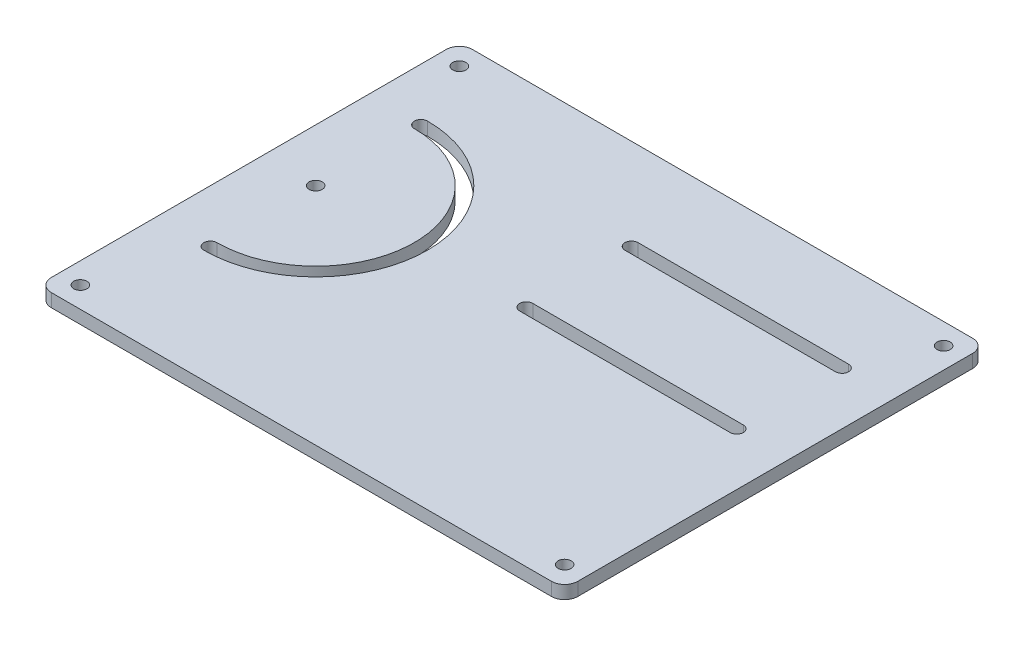
ISO-10303-21;
HEADER;
FILE_DESCRIPTION(('STEP AP214'),'2;1');
FILE_NAME('part.step','',(''),(''),'','','');
FILE_SCHEMA(('AUTOMOTIVE_DESIGN { 1 0 10303 214 1 1 1 1 }'));
ENDSEC;
DATA;
#1=APPLICATION_CONTEXT('core data for automotive mechanical design processes');
#2=APPLICATION_PROTOCOL_DEFINITION('international standard','automotive_design',2000,#1);
#3=PRODUCT_CONTEXT('',#1,'mechanical');
#4=PRODUCT('Part','Part','',(#3));
#5=PRODUCT_RELATED_PRODUCT_CATEGORY('part','',(#4));
#6=PRODUCT_DEFINITION_FORMATION('','',#4);
#7=PRODUCT_DEFINITION_CONTEXT('part definition',#1,'design');
#8=PRODUCT_DEFINITION('design','',#6,#7);
#9=PRODUCT_DEFINITION_SHAPE('','',#8);
#10=(LENGTH_UNIT() NAMED_UNIT(*) SI_UNIT(.MILLI.,.METRE.));
#11=(NAMED_UNIT(*) PLANE_ANGLE_UNIT() SI_UNIT($,.RADIAN.));
#12=(NAMED_UNIT(*) SI_UNIT($,.STERADIAN.) SOLID_ANGLE_UNIT());
#13=UNCERTAINTY_MEASURE_WITH_UNIT(LENGTH_MEASURE(1.E-05),#10,'distance_accuracy_value','');
#14=(GEOMETRIC_REPRESENTATION_CONTEXT(3) GLOBAL_UNCERTAINTY_ASSIGNED_CONTEXT((#13)) GLOBAL_UNIT_ASSIGNED_CONTEXT((#10,
#11,#12)) REPRESENTATION_CONTEXT('',''));
#15=CARTESIAN_POINT('',(0.,0.,0.));
#16=DIRECTION('',(0.,0.,1.));
#17=DIRECTION('',(1.,0.,0.));
#18=AXIS2_PLACEMENT_3D('',#15,#16,#17);
#19=CARTESIAN_POINT('',(0.,3.175,-101.6));
#20=DIRECTION('',(0.,0.,-1.));
#21=DIRECTION('',(-1.,0.,0.));
#22=AXIS2_PLACEMENT_3D('',#19,#20,#21);
#23=PLANE('',#22);
#24=DIRECTION('',(1.,0.,0.));
#25=VECTOR('',#24,1.);
#26=CARTESIAN_POINT('',(0.,0.,-101.6));
#27=LINE('',#26,#25);
#28=CARTESIAN_POINT('',(3.17500000000002,0.,-101.6));
#29=VERTEX_POINT('',#28);
#30=CARTESIAN_POINT('',(123.825,0.,-101.6));
#31=VERTEX_POINT('',#30);
#32=EDGE_CURVE('E302',#29,#31,#27,.T.);
#33=ORIENTED_EDGE('',*,*,#32,.F.);
#34=DIRECTION('',(0.,-1.,0.));
#35=VECTOR('',#34,1.);
#36=CARTESIAN_POINT('',(3.17500000000002,3.175,-101.6));
#37=LINE('',#36,#35);
#38=CARTESIAN_POINT('',(3.17500000000002,3.175,-101.6));
#39=VERTEX_POINT('',#38);
#40=EDGE_CURVE('E11',#39,#29,#37,.T.);
#41=ORIENTED_EDGE('',*,*,#40,.F.);
#42=DIRECTION('',(1.,0.,0.));
#43=VECTOR('',#42,1.);
#44=CARTESIAN_POINT('',(0.,3.175,-101.6));
#45=LINE('',#44,#43);
#46=CARTESIAN_POINT('',(123.825,3.175,-101.6));
#47=VERTEX_POINT('',#46);
#48=EDGE_CURVE('E368',#39,#47,#45,.T.);
#49=ORIENTED_EDGE('',*,*,#48,.T.);
#50=DIRECTION('',(0.,-1.,0.));
#51=VECTOR('',#50,1.);
#52=CARTESIAN_POINT('',(123.825,3.175,-101.6));
#53=LINE('',#52,#51);
#54=EDGE_CURVE('E125',#47,#31,#53,.T.);
#55=ORIENTED_EDGE('',*,*,#54,.T.);
#56=EDGE_LOOP('',(#33,#41,#49,#55));
#57=FACE_BOUND('',#56,.T.);
#58=ADVANCED_FACE('F36',(#57),#23,.T.);
#59=CARTESIAN_POINT('',(3.175,3.175,-98.425));
#60=DIRECTION('',(0.,-1.,0.));
#61=DIRECTION('',(0.,0.,-1.));
#62=AXIS2_PLACEMENT_3D('',#59,#60,#61);
#63=CYLINDRICAL_SURFACE('',#62,3.175);
#64=CARTESIAN_POINT('',(3.175,0.,-98.425));
#65=DIRECTION('',(0.,1.,0.));
#66=DIRECTION('',(0.,0.,1.));
#67=AXIS2_PLACEMENT_3D('',#64,#65,#66);
#68=CIRCLE('',#67,3.175);
#69=CARTESIAN_POINT('',(0.,0.,-98.425));
#70=VERTEX_POINT('',#69);
#71=EDGE_CURVE('E304',#29,#70,#68,.T.);
#72=ORIENTED_EDGE('',*,*,#71,.T.);
#73=DIRECTION('',(0.,-1.,0.));
#74=VECTOR('',#73,1.);
#75=CARTESIAN_POINT('',(0.,3.175,-98.425));
#76=LINE('',#75,#74);
#77=CARTESIAN_POINT('',(0.,3.175,-98.425));
#78=VERTEX_POINT('',#77);
#79=EDGE_CURVE('E46',#78,#70,#76,.T.);
#80=ORIENTED_EDGE('',*,*,#79,.F.);
#81=CARTESIAN_POINT('',(3.175,3.175,-98.425));
#82=DIRECTION('',(0.,1.,0.));
#83=DIRECTION('',(0.,0.,1.));
#84=AXIS2_PLACEMENT_3D('',#81,#82,#83);
#85=CIRCLE('',#84,3.175);
#86=EDGE_CURVE('E370',#39,#78,#85,.T.);
#87=ORIENTED_EDGE('',*,*,#86,.F.);
#88=ORIENTED_EDGE('',*,*,#40,.T.);
#89=EDGE_LOOP('',(#72,#80,#87,#88));
#90=FACE_BOUND('',#89,.T.);
#91=ADVANCED_FACE('F393',(#90),#63,.T.);
#92=CARTESIAN_POINT('',(0.,3.175,0.));
#93=DIRECTION('',(-1.,0.,0.));
#94=DIRECTION('',(0.,0.,1.));
#95=AXIS2_PLACEMENT_3D('',#92,#93,#94);
#96=PLANE('',#95);
#97=DIRECTION('',(0.,0.,-1.));
#98=VECTOR('',#97,1.);
#99=CARTESIAN_POINT('',(0.,0.,0.));
#100=LINE('',#99,#98);
#101=CARTESIAN_POINT('',(0.,0.,-3.17500000000002));
#102=VERTEX_POINT('',#101);
#103=EDGE_CURVE('E307',#102,#70,#100,.T.);
#104=ORIENTED_EDGE('',*,*,#103,.F.);
#105=DIRECTION('',(0.,-1.,0.));
#106=VECTOR('',#105,1.);
#107=CARTESIAN_POINT('',(0.,3.175,-3.17500000000002));
#108=LINE('',#107,#106);
#109=CARTESIAN_POINT('',(0.,3.175,-3.17500000000002));
#110=VERTEX_POINT('',#109);
#111=EDGE_CURVE('E214',#110,#102,#108,.T.);
#112=ORIENTED_EDGE('',*,*,#111,.F.);
#113=DIRECTION('',(0.,0.,-1.));
#114=VECTOR('',#113,1.);
#115=CARTESIAN_POINT('',(0.,3.175,0.));
#116=LINE('',#115,#114);
#117=EDGE_CURVE('E372',#110,#78,#116,.T.);
#118=ORIENTED_EDGE('',*,*,#117,.T.);
#119=ORIENTED_EDGE('',*,*,#79,.T.);
#120=EDGE_LOOP('',(#104,#112,#118,#119));
#121=FACE_BOUND('',#120,.T.);
#122=ADVANCED_FACE('F389',(#121),#96,.T.);
#123=CARTESIAN_POINT('',(3.175,3.175,-3.175));
#124=DIRECTION('',(0.,-1.,0.));
#125=DIRECTION('',(0.,0.,-1.));
#126=AXIS2_PLACEMENT_3D('',#123,#124,#125);
#127=CYLINDRICAL_SURFACE('',#126,3.175);
#128=CARTESIAN_POINT('',(3.175,0.,-3.175));
#129=DIRECTION('',(0.,1.,0.));
#130=DIRECTION('',(0.,0.,1.));
#131=AXIS2_PLACEMENT_3D('',#128,#129,#130);
#132=CIRCLE('',#131,3.175);
#133=CARTESIAN_POINT('',(3.17500000000002,0.,0.));
#134=VERTEX_POINT('',#133);
#135=EDGE_CURVE('E310',#102,#134,#132,.T.);
#136=ORIENTED_EDGE('',*,*,#135,.T.);
#137=DIRECTION('',(0.,-1.,0.));
#138=VECTOR('',#137,1.);
#139=CARTESIAN_POINT('',(3.17500000000002,3.175,0.));
#140=LINE('',#139,#138);
#141=CARTESIAN_POINT('',(3.17500000000002,3.175,0.));
#142=VERTEX_POINT('',#141);
#143=EDGE_CURVE('E207',#142,#134,#140,.T.);
#144=ORIENTED_EDGE('',*,*,#143,.F.);
#145=CARTESIAN_POINT('',(3.175,3.175,-3.175));
#146=DIRECTION('',(0.,1.,0.));
#147=DIRECTION('',(0.,0.,1.));
#148=AXIS2_PLACEMENT_3D('',#145,#146,#147);
#149=CIRCLE('',#148,3.175);
#150=EDGE_CURVE('E375',#110,#142,#149,.T.);
#151=ORIENTED_EDGE('',*,*,#150,.F.);
#152=ORIENTED_EDGE('',*,*,#111,.T.);
#153=EDGE_LOOP('',(#136,#144,#151,#152));
#154=FACE_BOUND('',#153,.T.);
#155=ADVANCED_FACE('F381',(#154),#127,.T.);
#156=CARTESIAN_POINT('',(0.,3.175,0.));
#157=DIRECTION('',(0.,0.,-1.));
#158=DIRECTION('',(-1.,0.,0.));
#159=AXIS2_PLACEMENT_3D('',#156,#157,#158);
#160=PLANE('',#159);
#161=DIRECTION('',(1.,0.,0.));
#162=VECTOR('',#161,1.);
#163=CARTESIAN_POINT('',(0.,0.,0.));
#164=LINE('',#163,#162);
#165=CARTESIAN_POINT('',(123.825,0.,0.));
#166=VERTEX_POINT('',#165);
#167=EDGE_CURVE('E313',#134,#166,#164,.T.);
#168=ORIENTED_EDGE('',*,*,#167,.T.);
#169=DIRECTION('',(0.,-1.,0.));
#170=VECTOR('',#169,1.);
#171=CARTESIAN_POINT('',(123.825,3.175,0.));
#172=LINE('',#171,#170);
#173=CARTESIAN_POINT('',(123.825,3.175,0.));
#174=VERTEX_POINT('',#173);
#175=EDGE_CURVE('E205',#174,#166,#172,.T.);
#176=ORIENTED_EDGE('',*,*,#175,.F.);
#177=DIRECTION('',(1.,0.,0.));
#178=VECTOR('',#177,1.);
#179=CARTESIAN_POINT('',(0.,3.175,0.));
#180=LINE('',#179,#178);
#181=EDGE_CURVE('E198',#142,#174,#180,.T.);
#182=ORIENTED_EDGE('',*,*,#181,.F.);
#183=ORIENTED_EDGE('',*,*,#143,.T.);
#184=EDGE_LOOP('',(#168,#176,#182,#183));
#185=FACE_BOUND('',#184,.T.);
#186=ADVANCED_FACE('F384',(#185),#160,.F.);
#187=CARTESIAN_POINT('',(123.825,3.175,-3.175));
#188=DIRECTION('',(0.,-1.,0.));
#189=DIRECTION('',(0.,0.,-1.));
#190=AXIS2_PLACEMENT_3D('',#187,#188,#189);
#191=CYLINDRICAL_SURFACE('',#190,3.175);
#192=CARTESIAN_POINT('',(123.825,0.,-3.175));
#193=DIRECTION('',(0.,1.,0.));
#194=DIRECTION('',(0.,0.,1.));
#195=AXIS2_PLACEMENT_3D('',#192,#193,#194);
#196=CIRCLE('',#195,3.175);
#197=CARTESIAN_POINT('',(127.,0.,-3.17500000000002));
#198=VERTEX_POINT('',#197);
#199=EDGE_CURVE('E204',#166,#198,#196,.T.);
#200=ORIENTED_EDGE('',*,*,#199,.T.);
#201=DIRECTION('',(0.,-1.,0.));
#202=VECTOR('',#201,1.);
#203=CARTESIAN_POINT('',(127.,3.175,-3.17500000000002));
#204=LINE('',#203,#202);
#205=CARTESIAN_POINT('',(127.,3.175,-3.17500000000002));
#206=VERTEX_POINT('',#205);
#207=EDGE_CURVE('E190',#206,#198,#204,.T.);
#208=ORIENTED_EDGE('',*,*,#207,.F.);
#209=CARTESIAN_POINT('',(123.825,3.175,-3.175));
#210=DIRECTION('',(0.,1.,0.));
#211=DIRECTION('',(0.,0.,1.));
#212=AXIS2_PLACEMENT_3D('',#209,#210,#211);
#213=CIRCLE('',#212,3.175);
#214=EDGE_CURVE('E193',#174,#206,#213,.T.);
#215=ORIENTED_EDGE('',*,*,#214,.F.);
#216=ORIENTED_EDGE('',*,*,#175,.T.);
#217=EDGE_LOOP('',(#200,#208,#215,#216));
#218=FACE_BOUND('',#217,.T.);
#219=ADVANCED_FACE('F203',(#218),#191,.T.);
#220=CARTESIAN_POINT('',(127.,3.175,0.));
#221=DIRECTION('',(-1.,0.,0.));
#222=DIRECTION('',(0.,0.,1.));
#223=AXIS2_PLACEMENT_3D('',#220,#221,#222);
#224=PLANE('',#223);
#225=DIRECTION('',(0.,0.,-1.));
#226=VECTOR('',#225,1.);
#227=CARTESIAN_POINT('',(127.,0.,0.));
#228=LINE('',#227,#226);
#229=CARTESIAN_POINT('',(127.,0.,-98.425));
#230=VERTEX_POINT('',#229);
#231=EDGE_CURVE('E317',#198,#230,#228,.T.);
#232=ORIENTED_EDGE('',*,*,#231,.T.);
#233=DIRECTION('',(0.,-1.,0.));
#234=VECTOR('',#233,1.);
#235=CARTESIAN_POINT('',(127.,3.175,-98.425));
#236=LINE('',#235,#234);
#237=CARTESIAN_POINT('',(127.,3.175,-98.425));
#238=VERTEX_POINT('',#237);
#239=EDGE_CURVE('E192',#238,#230,#236,.T.);
#240=ORIENTED_EDGE('',*,*,#239,.F.);
#241=DIRECTION('',(0.,0.,-1.));
#242=VECTOR('',#241,1.);
#243=CARTESIAN_POINT('',(127.,3.175,0.));
#244=LINE('',#243,#242);
#245=EDGE_CURVE('E185',#206,#238,#244,.T.);
#246=ORIENTED_EDGE('',*,*,#245,.F.);
#247=ORIENTED_EDGE('',*,*,#207,.T.);
#248=EDGE_LOOP('',(#232,#240,#246,#247));
#249=FACE_BOUND('',#248,.T.);
#250=ADVANCED_FACE('F188',(#249),#224,.F.);
#251=CARTESIAN_POINT('',(63.5,3.175,-54.2291480109511));
#252=DIRECTION('',(0.,-1.,0.));
#253=DIRECTION('',(0.,0.,-1.));
#254=AXIS2_PLACEMENT_3D('',#251,#252,#253);
#255=CYLINDRICAL_SURFACE('',#254,1.5875);
#256=CARTESIAN_POINT('',(63.5,0.,-54.2291480109511));
#257=DIRECTION('',(0.,1.,0.));
#258=DIRECTION('',(0.,0.,1.));
#259=AXIS2_PLACEMENT_3D('',#256,#257,#258);
#260=CIRCLE('',#259,1.5875);
#261=CARTESIAN_POINT('',(63.5,0.,-55.8166480109511));
#262=VERTEX_POINT('',#261);
#263=CARTESIAN_POINT('',(63.5,0.,-52.6416480109511));
#264=VERTEX_POINT('',#263);
#265=EDGE_CURVE('E278',#262,#264,#260,.T.);
#266=ORIENTED_EDGE('',*,*,#265,.F.);
#267=DIRECTION('',(0.,-1.,0.));
#268=VECTOR('',#267,1.);
#269=CARTESIAN_POINT('',(63.5,3.175,-55.8166480109511));
#270=LINE('',#269,#268);
#271=CARTESIAN_POINT('',(63.5,3.175,-55.8166480109511));
#272=VERTEX_POINT('',#271);
#273=EDGE_CURVE('E225',#272,#262,#270,.T.);
#274=ORIENTED_EDGE('',*,*,#273,.F.);
#275=CARTESIAN_POINT('',(63.5,3.175,-54.2291480109511));
#276=DIRECTION('',(0.,1.,0.));
#277=DIRECTION('',(0.,0.,1.));
#278=AXIS2_PLACEMENT_3D('',#275,#276,#277);
#279=CIRCLE('',#278,1.5875);
#280=CARTESIAN_POINT('',(63.5,3.175,-52.6416480109511));
#281=VERTEX_POINT('',#280);
#282=EDGE_CURVE('E345',#272,#281,#279,.T.);
#283=ORIENTED_EDGE('',*,*,#282,.T.);
#284=DIRECTION('',(0.,-1.,0.));
#285=VECTOR('',#284,1.);
#286=CARTESIAN_POINT('',(63.5,3.175,-52.6416480109511));
#287=LINE('',#286,#285);
#288=EDGE_CURVE('E217',#281,#264,#287,.T.);
#289=ORIENTED_EDGE('',*,*,#288,.T.);
#290=EDGE_LOOP('',(#266,#274,#283,#289));
#291=FACE_BOUND('',#290,.T.);
#292=ADVANCED_FACE('F432',(#291),#255,.F.);
#293=CARTESIAN_POINT('',(0.,3.175,-55.8166480109511));
#294=DIRECTION('',(0.,0.,-1.));
#295=DIRECTION('',(-1.,0.,0.));
#296=AXIS2_PLACEMENT_3D('',#293,#294,#295);
#297=PLANE('',#296);
#298=DIRECTION('',(1.,0.,0.));
#299=VECTOR('',#298,1.);
#300=CARTESIAN_POINT('',(0.,0.,-55.8166480109511));
#301=LINE('',#300,#299);
#302=CARTESIAN_POINT('',(114.3,0.,-55.8166480109511));
#303=VERTEX_POINT('',#302);
#304=EDGE_CURVE('E281',#262,#303,#301,.T.);
#305=ORIENTED_EDGE('',*,*,#304,.T.);
#306=DIRECTION('',(0.,-1.,0.));
#307=VECTOR('',#306,1.);
#308=CARTESIAN_POINT('',(114.3,3.175,-55.8166480109511));
#309=LINE('',#308,#307);
#310=CARTESIAN_POINT('',(114.3,3.175,-55.8166480109511));
#311=VERTEX_POINT('',#310);
#312=EDGE_CURVE('E222',#311,#303,#309,.T.);
#313=ORIENTED_EDGE('',*,*,#312,.F.);
#314=DIRECTION('',(1.,0.,0.));
#315=VECTOR('',#314,1.);
#316=CARTESIAN_POINT('',(0.,3.175,-55.8166480109511));
#317=LINE('',#316,#315);
#318=EDGE_CURVE('E348',#272,#311,#317,.T.);
#319=ORIENTED_EDGE('',*,*,#318,.F.);
#320=ORIENTED_EDGE('',*,*,#273,.T.);
#321=EDGE_LOOP('',(#305,#313,#319,#320));
#322=FACE_BOUND('',#321,.T.);
#323=ADVANCED_FACE('F428',(#322),#297,.F.);
#324=CARTESIAN_POINT('',(114.3,3.175,-54.2291480109511));
#325=DIRECTION('',(0.,-1.,0.));
#326=DIRECTION('',(0.,0.,-1.));
#327=AXIS2_PLACEMENT_3D('',#324,#325,#326);
#328=CYLINDRICAL_SURFACE('',#327,1.58750000000002);
#329=CARTESIAN_POINT('',(114.3,0.,-54.2291480109511));
#330=DIRECTION('',(0.,1.,0.));
#331=DIRECTION('',(0.,0.,1.));
#332=AXIS2_PLACEMENT_3D('',#329,#330,#331);
#333=CIRCLE('',#332,1.58750000000002);
#334=CARTESIAN_POINT('',(114.3,0.,-52.641648010951));
#335=VERTEX_POINT('',#334);
#336=EDGE_CURVE('E284',#303,#335,#333,.F.);
#337=ORIENTED_EDGE('',*,*,#336,.T.);
#338=DIRECTION('',(0.,-1.,0.));
#339=VECTOR('',#338,1.);
#340=CARTESIAN_POINT('',(114.3,3.175,-52.641648010951));
#341=LINE('',#340,#339);
#342=CARTESIAN_POINT('',(114.3,3.175,-52.641648010951));
#343=VERTEX_POINT('',#342);
#344=EDGE_CURVE('E219',#343,#335,#341,.T.);
#345=ORIENTED_EDGE('',*,*,#344,.F.);
#346=CARTESIAN_POINT('',(114.3,3.175,-54.2291480109511));
#347=DIRECTION('',(0.,1.,0.));
#348=DIRECTION('',(0.,0.,1.));
#349=AXIS2_PLACEMENT_3D('',#346,#347,#348);
#350=CIRCLE('',#349,1.58750000000002);
#351=EDGE_CURVE('E351',#311,#343,#350,.F.);
#352=ORIENTED_EDGE('',*,*,#351,.F.);
#353=ORIENTED_EDGE('',*,*,#312,.T.);
#354=EDGE_LOOP('',(#337,#345,#352,#353));
#355=FACE_BOUND('',#354,.T.);
#356=ADVANCED_FACE('F424',(#355),#328,.F.);
#357=CARTESIAN_POINT('',(114.3,3.175,-79.6291480109511));
#358=DIRECTION('',(0.,-1.,0.));
#359=DIRECTION('',(0.,0.,-1.));
#360=AXIS2_PLACEMENT_3D('',#357,#358,#359);
#361=CYLINDRICAL_SURFACE('',#360,1.58750000000002);
#362=CARTESIAN_POINT('',(114.3,0.,-79.6291480109511));
#363=DIRECTION('',(0.,1.,0.));
#364=DIRECTION('',(0.,0.,1.));
#365=AXIS2_PLACEMENT_3D('',#362,#363,#364);
#366=CIRCLE('',#365,1.58750000000002);
#367=CARTESIAN_POINT('',(114.3,0.,-78.0416480109511));
#368=VERTEX_POINT('',#367);
#369=CARTESIAN_POINT('',(114.3,0.,-81.2166480109511));
#370=VERTEX_POINT('',#369);
#371=EDGE_CURVE('E266',#368,#370,#366,.T.);
#372=ORIENTED_EDGE('',*,*,#371,.F.);
#373=DIRECTION('',(0.,-1.,0.));
#374=VECTOR('',#373,1.);
#375=CARTESIAN_POINT('',(114.3,3.175,-78.0416480109511));
#376=LINE('',#375,#374);
#377=CARTESIAN_POINT('',(114.3,3.175,-78.0416480109511));
#378=VERTEX_POINT('',#377);
#379=EDGE_CURVE('E220',#378,#368,#376,.T.);
#380=ORIENTED_EDGE('',*,*,#379,.F.);
#381=CARTESIAN_POINT('',(114.3,3.175,-79.6291480109511));
#382=DIRECTION('',(0.,1.,0.));
#383=DIRECTION('',(0.,0.,1.));
#384=AXIS2_PLACEMENT_3D('',#381,#382,#383);
#385=CIRCLE('',#384,1.58750000000002);
#386=CARTESIAN_POINT('',(114.3,3.175,-81.2166480109511));
#387=VERTEX_POINT('',#386);
#388=EDGE_CURVE('E334',#378,#387,#385,.T.);
#389=ORIENTED_EDGE('',*,*,#388,.T.);
#390=DIRECTION('',(0.,-1.,0.));
#391=VECTOR('',#390,1.);
#392=CARTESIAN_POINT('',(114.3,3.175,-81.2166480109511));
#393=LINE('',#392,#391);
#394=EDGE_CURVE('E227',#387,#370,#393,.T.);
#395=ORIENTED_EDGE('',*,*,#394,.T.);
#396=EDGE_LOOP('',(#372,#380,#389,#395));
#397=FACE_BOUND('',#396,.T.);
#398=ADVANCED_FACE('F427',(#397),#361,.F.);
#399=CARTESIAN_POINT('',(0.,3.175,-78.0416480109511));
#400=DIRECTION('',(0.,0.,-1.));
#401=DIRECTION('',(-1.,0.,0.));
#402=AXIS2_PLACEMENT_3D('',#399,#400,#401);
#403=PLANE('',#402);
#404=DIRECTION('',(1.,0.,0.));
#405=VECTOR('',#404,1.);
#406=CARTESIAN_POINT('',(0.,0.,-78.0416480109511));
#407=LINE('',#406,#405);
#408=CARTESIAN_POINT('',(63.5,0.,-78.0416480109511));
#409=VERTEX_POINT('',#408);
#410=EDGE_CURVE('E269',#409,#368,#407,.T.);
#411=ORIENTED_EDGE('',*,*,#410,.F.);
#412=DIRECTION('',(0.,-1.,0.));
#413=VECTOR('',#412,1.);
#414=CARTESIAN_POINT('',(63.5,3.175,-78.0416480109511));
#415=LINE('',#414,#413);
#416=CARTESIAN_POINT('',(63.5,3.175,-78.0416480109511));
#417=VERTEX_POINT('',#416);
#418=EDGE_CURVE('E232',#417,#409,#415,.T.);
#419=ORIENTED_EDGE('',*,*,#418,.F.);
#420=DIRECTION('',(1.,0.,0.));
#421=VECTOR('',#420,1.);
#422=CARTESIAN_POINT('',(0.,3.175,-78.0416480109511));
#423=LINE('',#422,#421);
#424=EDGE_CURVE('E337',#417,#378,#423,.T.);
#425=ORIENTED_EDGE('',*,*,#424,.T.);
#426=ORIENTED_EDGE('',*,*,#379,.T.);
#427=EDGE_LOOP('',(#411,#419,#425,#426));
#428=FACE_BOUND('',#427,.T.);
#429=ADVANCED_FACE('F444',(#428),#403,.T.);
#430=CARTESIAN_POINT('',(63.5,3.175,-79.6291480109511));
#431=DIRECTION('',(0.,-1.,0.));
#432=DIRECTION('',(0.,0.,-1.));
#433=AXIS2_PLACEMENT_3D('',#430,#431,#432);
#434=CYLINDRICAL_SURFACE('',#433,1.5875);
#435=CARTESIAN_POINT('',(63.5,0.,-79.6291480109511));
#436=DIRECTION('',(0.,1.,0.));
#437=DIRECTION('',(0.,0.,1.));
#438=AXIS2_PLACEMENT_3D('',#435,#436,#437);
#439=CIRCLE('',#438,1.5875);
#440=CARTESIAN_POINT('',(63.5,0.,-81.2166480109511));
#441=VERTEX_POINT('',#440);
#442=EDGE_CURVE('E272',#409,#441,#439,.F.);
#443=ORIENTED_EDGE('',*,*,#442,.T.);
#444=DIRECTION('',(0.,-1.,0.));
#445=VECTOR('',#444,1.);
#446=CARTESIAN_POINT('',(63.5,3.175,-81.2166480109511));
#447=LINE('',#446,#445);
#448=CARTESIAN_POINT('',(63.5,3.175,-81.2166480109511));
#449=VERTEX_POINT('',#448);
#450=EDGE_CURVE('E229',#449,#441,#447,.T.);
#451=ORIENTED_EDGE('',*,*,#450,.F.);
#452=CARTESIAN_POINT('',(63.5,3.175,-79.6291480109511));
#453=DIRECTION('',(0.,1.,0.));
#454=DIRECTION('',(0.,0.,1.));
#455=AXIS2_PLACEMENT_3D('',#452,#453,#454);
#456=CIRCLE('',#455,1.5875);
#457=EDGE_CURVE('E340',#417,#449,#456,.F.);
#458=ORIENTED_EDGE('',*,*,#457,.F.);
#459=ORIENTED_EDGE('',*,*,#418,.T.);
#460=EDGE_LOOP('',(#443,#451,#458,#459));
#461=FACE_BOUND('',#460,.T.);
#462=ADVANCED_FACE('F441',(#461),#434,.F.);
#463=CARTESIAN_POINT('',(12.7,3.175,-54.2291480109511));
#464=DIRECTION('',(0.,-1.,0.));
#465=DIRECTION('',(0.,0.,-1.));
#466=AXIS2_PLACEMENT_3D('',#463,#464,#465);
#467=CYLINDRICAL_SURFACE('',#466,26.9875);
#468=CARTESIAN_POINT('',(12.7,0.,-54.2291480109511));
#469=DIRECTION('',(0.,1.,0.));
#470=DIRECTION('',(0.,0.,1.));
#471=AXIS2_PLACEMENT_3D('',#468,#469,#470);
#472=CIRCLE('',#471,26.9875);
#473=CARTESIAN_POINT('',(12.7,0.,-81.2166480109511));
#474=VERTEX_POINT('',#473);
#475=CARTESIAN_POINT('',(12.7,0.,-27.2416480109511));
#476=VERTEX_POINT('',#475);
#477=EDGE_CURVE('E251',#474,#476,#472,.F.);
#478=ORIENTED_EDGE('',*,*,#477,.T.);
#479=DIRECTION('',(0.,-1.,0.));
#480=VECTOR('',#479,1.);
#481=CARTESIAN_POINT('',(12.7,3.175,-27.2416480109511));
#482=LINE('',#481,#480);
#483=CARTESIAN_POINT('',(12.7,3.175,-27.2416480109511));
#484=VERTEX_POINT('',#483);
#485=EDGE_CURVE('E40',#484,#476,#482,.T.);
#486=ORIENTED_EDGE('',*,*,#485,.F.);
#487=CARTESIAN_POINT('',(12.7,3.175,-54.2291480109511));
#488=DIRECTION('',(0.,1.,0.));
#489=DIRECTION('',(0.,0.,1.));
#490=AXIS2_PLACEMENT_3D('',#487,#488,#489);
#491=CIRCLE('',#490,26.9875);
#492=CARTESIAN_POINT('',(12.7,3.175,-81.2166480109511));
#493=VERTEX_POINT('',#492);
#494=EDGE_CURVE('E319',#493,#484,#491,.F.);
#495=ORIENTED_EDGE('',*,*,#494,.F.);
#496=DIRECTION('',(0.,-1.,0.));
#497=VECTOR('',#496,1.);
#498=CARTESIAN_POINT('',(12.7,3.175,-81.2166480109511));
#499=LINE('',#498,#497);
#500=EDGE_CURVE('E235',#493,#474,#499,.T.);
#501=ORIENTED_EDGE('',*,*,#500,.T.);
#502=EDGE_LOOP('',(#478,#486,#495,#501));
#503=FACE_BOUND('',#502,.T.);
#504=ADVANCED_FACE('F38',(#503),#467,.F.);
#505=CARTESIAN_POINT('',(12.7,3.175,-28.8291480109511));
#506=DIRECTION('',(0.,-1.,0.));
#507=DIRECTION('',(0.,0.,-1.));
#508=AXIS2_PLACEMENT_3D('',#505,#506,#507);
#509=CYLINDRICAL_SURFACE('',#508,1.5875);
#510=CARTESIAN_POINT('',(12.7,0.,-28.8291480109511));
#511=DIRECTION('',(0.,1.,0.));
#512=DIRECTION('',(0.,0.,1.));
#513=AXIS2_PLACEMENT_3D('',#510,#511,#512);
#514=CIRCLE('',#513,1.5875);
#515=CARTESIAN_POINT('',(12.7,0.,-30.4166480109511));
#516=VERTEX_POINT('',#515);
#517=EDGE_CURVE('E246',#476,#516,#514,.F.);
#518=ORIENTED_EDGE('',*,*,#517,.T.);
#519=DIRECTION('',(0.,-1.,0.));
#520=VECTOR('',#519,1.);
#521=CARTESIAN_POINT('',(12.7,3.175,-30.4166480109511));
#522=LINE('',#521,#520);
#523=CARTESIAN_POINT('',(12.7,3.175,-30.4166480109511));
#524=VERTEX_POINT('',#523);
#525=EDGE_CURVE('E238',#524,#516,#522,.T.);
#526=ORIENTED_EDGE('',*,*,#525,.F.);
#527=CARTESIAN_POINT('',(12.7,3.175,-28.8291480109511));
#528=DIRECTION('',(0.,1.,0.));
#529=DIRECTION('',(0.,0.,1.));
#530=AXIS2_PLACEMENT_3D('',#527,#528,#529);
#531=CIRCLE('',#530,1.5875);
#532=EDGE_CURVE('E133',#484,#524,#531,.F.);
#533=ORIENTED_EDGE('',*,*,#532,.F.);
#534=ORIENTED_EDGE('',*,*,#485,.T.);
#535=EDGE_LOOP('',(#518,#526,#533,#534));
#536=FACE_BOUND('',#535,.T.);
#537=ADVANCED_FACE('F245',(#536),#509,.F.);
#538=CARTESIAN_POINT('',(12.7,3.175,-54.2291480109511));
#539=DIRECTION('',(0.,-1.,0.));
#540=DIRECTION('',(0.,0.,-1.));
#541=AXIS2_PLACEMENT_3D('',#538,#539,#540);
#542=CYLINDRICAL_SURFACE('',#541,23.8125);
#543=CARTESIAN_POINT('',(12.7,0.,-54.2291480109511));
#544=DIRECTION('',(0.,1.,0.));
#545=DIRECTION('',(0.,0.,1.));
#546=AXIS2_PLACEMENT_3D('',#543,#544,#545);
#547=CIRCLE('',#546,23.8125);
#548=CARTESIAN_POINT('',(12.7,0.,-78.0416480109511));
#549=VERTEX_POINT('',#548);
#550=EDGE_CURVE('E256',#549,#516,#547,.F.);
#551=ORIENTED_EDGE('',*,*,#550,.F.);
#552=DIRECTION('',(0.,-1.,0.));
#553=VECTOR('',#552,1.);
#554=CARTESIAN_POINT('',(12.7,3.175,-78.0416480109511));
#555=LINE('',#554,#553);
#556=CARTESIAN_POINT('',(12.7,3.175,-78.0416480109511));
#557=VERTEX_POINT('',#556);
#558=EDGE_CURVE('E237',#557,#549,#555,.T.);
#559=ORIENTED_EDGE('',*,*,#558,.F.);
#560=CARTESIAN_POINT('',(12.7,3.175,-54.2291480109511));
#561=DIRECTION('',(0.,1.,0.));
#562=DIRECTION('',(0.,0.,1.));
#563=AXIS2_PLACEMENT_3D('',#560,#561,#562);
#564=CIRCLE('',#563,23.8125);
#565=EDGE_CURVE('E324',#557,#524,#564,.F.);
#566=ORIENTED_EDGE('',*,*,#565,.T.);
#567=ORIENTED_EDGE('',*,*,#525,.T.);
#568=EDGE_LOOP('',(#551,#559,#566,#567));
#569=FACE_BOUND('',#568,.T.);
#570=ADVANCED_FACE('F406',(#569),#542,.T.);
#571=CARTESIAN_POINT('',(121.92,3.175,-5.08));
#572=DIRECTION('',(0.,-1.,0.));
#573=DIRECTION('',(0.,0.,-1.));
#574=AXIS2_PLACEMENT_3D('',#571,#572,#573);
#575=CYLINDRICAL_SURFACE('',#574,1.5875);
#576=CARTESIAN_POINT('',(121.92,3.175,-5.08));
#577=DIRECTION('',(0.,1.,0.));
#578=DIRECTION('',(0.,0.,1.));
#579=AXIS2_PLACEMENT_3D('',#576,#577,#578);
#580=CIRCLE('',#579,1.5875);
#581=CARTESIAN_POINT('',(121.92,3.175,-3.4925));
#582=VERTEX_POINT('',#581);
#583=EDGE_CURVE('E365',#582,#582,#580,.T.);
#584=ORIENTED_EDGE('',*,*,#583,.T.);
#585=EDGE_LOOP('',(#584));
#586=FACE_BOUND('',#585,.T.);
#587=CARTESIAN_POINT('',(121.92,0.,-5.08));
#588=DIRECTION('',(0.,1.,0.));
#589=DIRECTION('',(0.,0.,1.));
#590=AXIS2_PLACEMENT_3D('',#587,#588,#589);
#591=CIRCLE('',#590,1.5875);
#592=CARTESIAN_POINT('',(121.92,0.,-3.4925));
#593=VERTEX_POINT('',#592);
#594=EDGE_CURVE('E299',#593,#593,#591,.T.);
#595=ORIENTED_EDGE('',*,*,#594,.F.);
#596=EDGE_LOOP('',(#595));
#597=FACE_BOUND('',#596,.T.);
#598=ADVANCED_FACE('F402',(#586,#597),#575,.F.);
#599=CARTESIAN_POINT('',(121.92,3.175,-96.52));
#600=DIRECTION('',(0.,-1.,0.));
#601=DIRECTION('',(0.,0.,-1.));
#602=AXIS2_PLACEMENT_3D('',#599,#600,#601);
#603=CYLINDRICAL_SURFACE('',#602,1.5875);
#604=CARTESIAN_POINT('',(121.92,3.175,-96.52));
#605=DIRECTION('',(0.,1.,0.));
#606=DIRECTION('',(0.,0.,1.));
#607=AXIS2_PLACEMENT_3D('',#604,#605,#606);
#608=CIRCLE('',#607,1.5875);
#609=CARTESIAN_POINT('',(121.92,3.175,-94.9325));
#610=VERTEX_POINT('',#609);
#611=EDGE_CURVE('E362',#610,#610,#608,.T.);
#612=ORIENTED_EDGE('',*,*,#611,.T.);
#613=EDGE_LOOP('',(#612));
#614=FACE_BOUND('',#613,.T.);
#615=CARTESIAN_POINT('',(121.92,0.,-96.52));
#616=DIRECTION('',(0.,1.,0.));
#617=DIRECTION('',(0.,0.,1.));
#618=AXIS2_PLACEMENT_3D('',#615,#616,#617);
#619=CIRCLE('',#618,1.5875);
#620=CARTESIAN_POINT('',(121.92,0.,-94.9325));
#621=VERTEX_POINT('',#620);
#622=EDGE_CURVE('E296',#621,#621,#619,.T.);
#623=ORIENTED_EDGE('',*,*,#622,.F.);
#624=EDGE_LOOP('',(#623));
#625=FACE_BOUND('',#624,.T.);
#626=ADVANCED_FACE('F405',(#614,#625),#603,.F.);
#627=CARTESIAN_POINT('',(5.08,3.175,-5.08));
#628=DIRECTION('',(0.,-1.,0.));
#629=DIRECTION('',(0.,0.,-1.));
#630=AXIS2_PLACEMENT_3D('',#627,#628,#629);
#631=CYLINDRICAL_SURFACE('',#630,1.5875);
#632=CARTESIAN_POINT('',(5.08,3.175,-5.08));
#633=DIRECTION('',(0.,1.,0.));
#634=DIRECTION('',(0.,0.,1.));
#635=AXIS2_PLACEMENT_3D('',#632,#633,#634);
#636=CIRCLE('',#635,1.5875);
#637=CARTESIAN_POINT('',(5.08,3.175,-3.4925));
#638=VERTEX_POINT('',#637);
#639=EDGE_CURVE('E359',#638,#638,#636,.T.);
#640=ORIENTED_EDGE('',*,*,#639,.T.);
#641=EDGE_LOOP('',(#640));
#642=FACE_BOUND('',#641,.T.);
#643=CARTESIAN_POINT('',(5.08,0.,-5.08));
#644=DIRECTION('',(0.,1.,0.));
#645=DIRECTION('',(0.,0.,1.));
#646=AXIS2_PLACEMENT_3D('',#643,#644,#645);
#647=CIRCLE('',#646,1.5875);
#648=CARTESIAN_POINT('',(5.08,0.,-3.4925));
#649=VERTEX_POINT('',#648);
#650=EDGE_CURVE('E293',#649,#649,#647,.T.);
#651=ORIENTED_EDGE('',*,*,#650,.F.);
#652=EDGE_LOOP('',(#651));
#653=FACE_BOUND('',#652,.T.);
#654=ADVANCED_FACE('F410',(#642,#653),#631,.F.);
#655=CARTESIAN_POINT('',(5.08,3.175,-96.52));
#656=DIRECTION('',(0.,-1.,0.));
#657=DIRECTION('',(0.,0.,-1.));
#658=AXIS2_PLACEMENT_3D('',#655,#656,#657);
#659=CYLINDRICAL_SURFACE('',#658,1.5875);
#660=CARTESIAN_POINT('',(5.08,3.175,-96.52));
#661=DIRECTION('',(0.,1.,0.));
#662=DIRECTION('',(0.,0.,1.));
#663=AXIS2_PLACEMENT_3D('',#660,#661,#662);
#664=CIRCLE('',#663,1.5875);
#665=CARTESIAN_POINT('',(5.08,3.175,-94.9325));
#666=VERTEX_POINT('',#665);
#667=EDGE_CURVE('E356',#666,#666,#664,.T.);
#668=ORIENTED_EDGE('',*,*,#667,.T.);
#669=EDGE_LOOP('',(#668));
#670=FACE_BOUND('',#669,.T.);
#671=CARTESIAN_POINT('',(5.08,0.,-96.52));
#672=DIRECTION('',(0.,1.,0.));
#673=DIRECTION('',(0.,0.,1.));
#674=AXIS2_PLACEMENT_3D('',#671,#672,#673);
#675=CIRCLE('',#674,1.5875);
#676=CARTESIAN_POINT('',(5.08,0.,-94.9325));
#677=VERTEX_POINT('',#676);
#678=EDGE_CURVE('E290',#677,#677,#675,.T.);
#679=ORIENTED_EDGE('',*,*,#678,.F.);
#680=EDGE_LOOP('',(#679));
#681=FACE_BOUND('',#680,.T.);
#682=ADVANCED_FACE('F414',(#670,#681),#659,.F.);
#683=CARTESIAN_POINT('',(0.,3.175,-52.6416480109511));
#684=DIRECTION('',(0.,0.,-1.));
#685=DIRECTION('',(-1.,0.,0.));
#686=AXIS2_PLACEMENT_3D('',#683,#684,#685);
#687=PLANE('',#686);
#688=DIRECTION('',(1.,0.,0.));
#689=VECTOR('',#688,1.);
#690=CARTESIAN_POINT('',(0.,0.,-52.6416480109511));
#691=LINE('',#690,#689);
#692=EDGE_CURVE('E287',#264,#335,#691,.T.);
#693=ORIENTED_EDGE('',*,*,#692,.F.);
#694=ORIENTED_EDGE('',*,*,#288,.F.);
#695=DIRECTION('',(1.,0.,0.));
#696=VECTOR('',#695,1.);
#697=CARTESIAN_POINT('',(0.,3.175,-52.6416480109511));
#698=LINE('',#697,#696);
#699=EDGE_CURVE('E353',#281,#343,#698,.T.);
#700=ORIENTED_EDGE('',*,*,#699,.T.);
#701=ORIENTED_EDGE('',*,*,#344,.T.);
#702=EDGE_LOOP('',(#693,#694,#700,#701));
#703=FACE_BOUND('',#702,.T.);
#704=ADVANCED_FACE('F418',(#703),#687,.T.);
#705=CARTESIAN_POINT('',(0.,3.175,-81.216648010951));
#706=DIRECTION('',(0.,0.,-1.));
#707=DIRECTION('',(-1.,0.,0.));
#708=AXIS2_PLACEMENT_3D('',#705,#706,#707);
#709=PLANE('',#708);
#710=DIRECTION('',(1.,0.,0.));
#711=VECTOR('',#710,1.);
#712=CARTESIAN_POINT('',(0.,0.,-81.216648010951));
#713=LINE('',#712,#711);
#714=EDGE_CURVE('E275',#441,#370,#713,.T.);
#715=ORIENTED_EDGE('',*,*,#714,.T.);
#716=ORIENTED_EDGE('',*,*,#394,.F.);
#717=DIRECTION('',(1.,0.,0.));
#718=VECTOR('',#717,1.);
#719=CARTESIAN_POINT('',(0.,3.175,-81.216648010951));
#720=LINE('',#719,#718);
#721=EDGE_CURVE('E343',#449,#387,#720,.T.);
#722=ORIENTED_EDGE('',*,*,#721,.F.);
#723=ORIENTED_EDGE('',*,*,#450,.T.);
#724=EDGE_LOOP('',(#715,#716,#722,#723));
#725=FACE_BOUND('',#724,.T.);
#726=ADVANCED_FACE('F422',(#725),#709,.F.);
#727=CARTESIAN_POINT('',(12.7,3.175,-54.2291480109511));
#728=DIRECTION('',(0.,-1.,0.));
#729=DIRECTION('',(0.,0.,-1.));
#730=AXIS2_PLACEMENT_3D('',#727,#728,#729);
#731=CYLINDRICAL_SURFACE('',#730,1.5875);
#732=CARTESIAN_POINT('',(12.7,3.175,-54.2291480109511));
#733=DIRECTION('',(0.,1.,0.));
#734=DIRECTION('',(0.,0.,1.));
#735=AXIS2_PLACEMENT_3D('',#732,#733,#734);
#736=CIRCLE('',#735,1.5875);
#737=CARTESIAN_POINT('',(12.7,3.175,-52.6416480109511));
#738=VERTEX_POINT('',#737);
#739=EDGE_CURVE('E331',#738,#738,#736,.T.);
#740=ORIENTED_EDGE('',*,*,#739,.T.);
#741=EDGE_LOOP('',(#740));
#742=FACE_BOUND('',#741,.T.);
#743=CARTESIAN_POINT('',(12.7,0.,-54.2291480109511));
#744=DIRECTION('',(0.,1.,0.));
#745=DIRECTION('',(0.,0.,1.));
#746=AXIS2_PLACEMENT_3D('',#743,#744,#745);
#747=CIRCLE('',#746,1.5875);
#748=CARTESIAN_POINT('',(12.7,0.,-52.6416480109511));
#749=VERTEX_POINT('',#748);
#750=EDGE_CURVE('E263',#749,#749,#747,.T.);
#751=ORIENTED_EDGE('',*,*,#750,.F.);
#752=EDGE_LOOP('',(#751));
#753=FACE_BOUND('',#752,.T.);
#754=ADVANCED_FACE('F439',(#742,#753),#731,.F.);
#755=CARTESIAN_POINT('',(12.7,3.175,-79.6291480109511));
#756=DIRECTION('',(0.,-1.,0.));
#757=DIRECTION('',(0.,0.,-1.));
#758=AXIS2_PLACEMENT_3D('',#755,#756,#757);
#759=CYLINDRICAL_SURFACE('',#758,1.5875);
#760=CARTESIAN_POINT('',(12.7,0.,-79.6291480109511));
#761=DIRECTION('',(0.,1.,0.));
#762=DIRECTION('',(0.,0.,1.));
#763=AXIS2_PLACEMENT_3D('',#760,#761,#762);
#764=CIRCLE('',#763,1.5875);
#765=EDGE_CURVE('E261',#474,#549,#764,.T.);
#766=ORIENTED_EDGE('',*,*,#765,.F.);
#767=ORIENTED_EDGE('',*,*,#500,.F.);
#768=CARTESIAN_POINT('',(12.7,3.175,-79.6291480109511));
#769=DIRECTION('',(0.,1.,0.));
#770=DIRECTION('',(0.,0.,1.));
#771=AXIS2_PLACEMENT_3D('',#768,#769,#770);
#772=CIRCLE('',#771,1.5875);
#773=EDGE_CURVE('E328',#493,#557,#772,.T.);
#774=ORIENTED_EDGE('',*,*,#773,.T.);
#775=ORIENTED_EDGE('',*,*,#558,.T.);
#776=EDGE_LOOP('',(#766,#767,#774,#775));
#777=FACE_BOUND('',#776,.T.);
#778=ADVANCED_FACE('F454',(#777),#759,.F.);
#779=CARTESIAN_POINT('',(123.825,3.175,-98.425));
#780=DIRECTION('',(0.,-1.,0.));
#781=DIRECTION('',(0.,0.,-1.));
#782=AXIS2_PLACEMENT_3D('',#779,#780,#781);
#783=CYLINDRICAL_SURFACE('',#782,3.175);
#784=CARTESIAN_POINT('',(123.825,0.,-98.425));
#785=DIRECTION('',(0.,1.,0.));
#786=DIRECTION('',(0.,0.,1.));
#787=AXIS2_PLACEMENT_3D('',#784,#785,#786);
#788=CIRCLE('',#787,3.175);
#789=EDGE_CURVE('E118',#230,#31,#788,.T.);
#790=ORIENTED_EDGE('',*,*,#789,.T.);
#791=ORIENTED_EDGE('',*,*,#54,.F.);
#792=CARTESIAN_POINT('',(123.825,3.175,-98.425));
#793=DIRECTION('',(0.,1.,0.));
#794=DIRECTION('',(0.,0.,1.));
#795=AXIS2_PLACEMENT_3D('',#792,#793,#794);
#796=CIRCLE('',#795,3.175);
#797=EDGE_CURVE('E55',#238,#47,#796,.T.);
#798=ORIENTED_EDGE('',*,*,#797,.F.);
#799=ORIENTED_EDGE('',*,*,#239,.T.);
#800=EDGE_LOOP('',(#790,#791,#798,#799));
#801=FACE_BOUND('',#800,.T.);
#802=ADVANCED_FACE('F458',(#801),#783,.T.);
#803=CARTESIAN_POINT('',(0.,3.175,0.));
#804=DIRECTION('',(0.,1.,0.));
#805=DIRECTION('',(0.,0.,1.));
#806=AXIS2_PLACEMENT_3D('',#803,#804,#805);
#807=PLANE('',#806);
#808=ORIENTED_EDGE('',*,*,#494,.T.);
#809=ORIENTED_EDGE('',*,*,#532,.T.);
#810=ORIENTED_EDGE('',*,*,#565,.F.);
#811=ORIENTED_EDGE('',*,*,#773,.F.);
#812=EDGE_LOOP('',(#808,#809,#810,#811));
#813=FACE_BOUND('',#812,.T.);
#814=ORIENTED_EDGE('',*,*,#739,.F.);
#815=EDGE_LOOP('',(#814));
#816=FACE_BOUND('',#815,.T.);
#817=ORIENTED_EDGE('',*,*,#388,.F.);
#818=ORIENTED_EDGE('',*,*,#424,.F.);
#819=ORIENTED_EDGE('',*,*,#457,.T.);
#820=ORIENTED_EDGE('',*,*,#721,.T.);
#821=EDGE_LOOP('',(#817,#818,#819,#820));
#822=FACE_BOUND('',#821,.T.);
#823=ORIENTED_EDGE('',*,*,#282,.F.);
#824=ORIENTED_EDGE('',*,*,#318,.T.);
#825=ORIENTED_EDGE('',*,*,#351,.T.);
#826=ORIENTED_EDGE('',*,*,#699,.F.);
#827=EDGE_LOOP('',(#823,#824,#825,#826));
#828=FACE_BOUND('',#827,.T.);
#829=ORIENTED_EDGE('',*,*,#667,.F.);
#830=EDGE_LOOP('',(#829));
#831=FACE_BOUND('',#830,.T.);
#832=ORIENTED_EDGE('',*,*,#639,.F.);
#833=EDGE_LOOP('',(#832));
#834=FACE_BOUND('',#833,.T.);
#835=ORIENTED_EDGE('',*,*,#611,.F.);
#836=EDGE_LOOP('',(#835));
#837=FACE_BOUND('',#836,.T.);
#838=ORIENTED_EDGE('',*,*,#583,.F.);
#839=EDGE_LOOP('',(#838));
#840=FACE_BOUND('',#839,.T.);
#841=ORIENTED_EDGE('',*,*,#48,.F.);
#842=ORIENTED_EDGE('',*,*,#86,.T.);
#843=ORIENTED_EDGE('',*,*,#117,.F.);
#844=ORIENTED_EDGE('',*,*,#150,.T.);
#845=ORIENTED_EDGE('',*,*,#181,.T.);
#846=ORIENTED_EDGE('',*,*,#214,.T.);
#847=ORIENTED_EDGE('',*,*,#245,.T.);
#848=ORIENTED_EDGE('',*,*,#797,.T.);
#849=EDGE_LOOP('',(#841,#842,#843,#844,#845,#846,#847,#848));
#850=FACE_BOUND('',#849,.T.);
#851=ADVANCED_FACE('F196',(#813,#816,#822,#828,#831,#834,#837,#840,#850),#807,.T.);
#852=CARTESIAN_POINT('',(0.,0.,0.));
#853=DIRECTION('',(0.,1.,0.));
#854=DIRECTION('',(0.,0.,1.));
#855=AXIS2_PLACEMENT_3D('',#852,#853,#854);
#856=PLANE('',#855);
#857=ORIENTED_EDGE('',*,*,#477,.F.);
#858=ORIENTED_EDGE('',*,*,#765,.T.);
#859=ORIENTED_EDGE('',*,*,#550,.T.);
#860=ORIENTED_EDGE('',*,*,#517,.F.);
#861=EDGE_LOOP('',(#857,#858,#859,#860));
#862=FACE_BOUND('',#861,.T.);
#863=ORIENTED_EDGE('',*,*,#750,.T.);
#864=EDGE_LOOP('',(#863));
#865=FACE_BOUND('',#864,.T.);
#866=ORIENTED_EDGE('',*,*,#371,.T.);
#867=ORIENTED_EDGE('',*,*,#714,.F.);
#868=ORIENTED_EDGE('',*,*,#442,.F.);
#869=ORIENTED_EDGE('',*,*,#410,.T.);
#870=EDGE_LOOP('',(#866,#867,#868,#869));
#871=FACE_BOUND('',#870,.T.);
#872=ORIENTED_EDGE('',*,*,#265,.T.);
#873=ORIENTED_EDGE('',*,*,#692,.T.);
#874=ORIENTED_EDGE('',*,*,#336,.F.);
#875=ORIENTED_EDGE('',*,*,#304,.F.);
#876=EDGE_LOOP('',(#872,#873,#874,#875));
#877=FACE_BOUND('',#876,.T.);
#878=ORIENTED_EDGE('',*,*,#678,.T.);
#879=EDGE_LOOP('',(#878));
#880=FACE_BOUND('',#879,.T.);
#881=ORIENTED_EDGE('',*,*,#650,.T.);
#882=EDGE_LOOP('',(#881));
#883=FACE_BOUND('',#882,.T.);
#884=ORIENTED_EDGE('',*,*,#622,.T.);
#885=EDGE_LOOP('',(#884));
#886=FACE_BOUND('',#885,.T.);
#887=ORIENTED_EDGE('',*,*,#594,.T.);
#888=EDGE_LOOP('',(#887));
#889=FACE_BOUND('',#888,.T.);
#890=ORIENTED_EDGE('',*,*,#32,.T.);
#891=ORIENTED_EDGE('',*,*,#789,.F.);
#892=ORIENTED_EDGE('',*,*,#231,.F.);
#893=ORIENTED_EDGE('',*,*,#199,.F.);
#894=ORIENTED_EDGE('',*,*,#167,.F.);
#895=ORIENTED_EDGE('',*,*,#135,.F.);
#896=ORIENTED_EDGE('',*,*,#103,.T.);
#897=ORIENTED_EDGE('',*,*,#71,.F.);
#898=EDGE_LOOP('',(#890,#891,#892,#893,#894,#895,#896,#897));
#899=FACE_BOUND('',#898,.T.);
#900=ADVANCED_FACE('F385',(#862,#865,#871,#877,#880,#883,#886,#889,#899),#856,.F.);
#901=CLOSED_SHELL('',(#58,#91,#122,#155,#186,#219,#250,#292,#323,#356,#398,#429,#462,#504,#537,
#570,#598,#626,#654,#682,#704,#726,#754,#778,#802,#851,#900));
#902=MANIFOLD_SOLID_BREP('B2',#901);
#903=ADVANCED_BREP_SHAPE_REPRESENTATION('',(#18,#902),#14);
#904=SHAPE_DEFINITION_REPRESENTATION(#9,#903);
ENDSEC;
END-ISO-10303-21;
